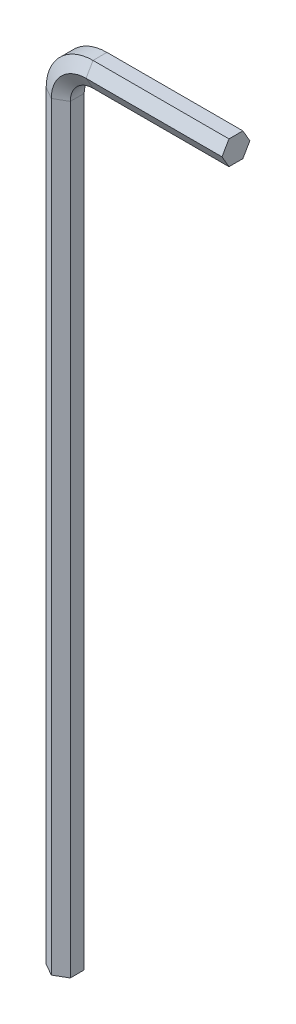
ISO-10303-21;
HEADER;
FILE_DESCRIPTION(('STEP AP214'),'2;1');
FILE_NAME('part.step','',(''),(''),'','','');
FILE_SCHEMA(('AUTOMOTIVE_DESIGN { 1 0 10303 214 1 1 1 1 }'));
ENDSEC;
DATA;
#1=APPLICATION_CONTEXT('core data for automotive mechanical design processes');
#2=APPLICATION_PROTOCOL_DEFINITION('international standard','automotive_design',2000,#1);
#3=PRODUCT_CONTEXT('',#1,'mechanical');
#4=PRODUCT('Part','Part','',(#3));
#5=PRODUCT_RELATED_PRODUCT_CATEGORY('part','',(#4));
#6=PRODUCT_DEFINITION_FORMATION('','',#4);
#7=PRODUCT_DEFINITION_CONTEXT('part definition',#1,'design');
#8=PRODUCT_DEFINITION('design','',#6,#7);
#9=PRODUCT_DEFINITION_SHAPE('','',#8);
#10=(LENGTH_UNIT() NAMED_UNIT(*) SI_UNIT(.MILLI.,.METRE.));
#11=(NAMED_UNIT(*) PLANE_ANGLE_UNIT() SI_UNIT($,.RADIAN.));
#12=(NAMED_UNIT(*) SI_UNIT($,.STERADIAN.) SOLID_ANGLE_UNIT());
#13=UNCERTAINTY_MEASURE_WITH_UNIT(LENGTH_MEASURE(1.E-05),#10,'distance_accuracy_value','');
#14=(GEOMETRIC_REPRESENTATION_CONTEXT(3) GLOBAL_UNCERTAINTY_ASSIGNED_CONTEXT((#13)) GLOBAL_UNIT_ASSIGNED_CONTEXT((#10,
#11,#12)) REPRESENTATION_CONTEXT('',''));
#15=CARTESIAN_POINT('',(0.,0.,0.));
#16=DIRECTION('',(0.,0.,1.));
#17=DIRECTION('',(1.,0.,0.));
#18=AXIS2_PLACEMENT_3D('',#15,#16,#17);
#19=CARTESIAN_POINT('',(4.00000000000003,91.2157,-1.5984519552784));
#20=DIRECTION('',(0.,0.500000000000001,-0.866025403784438));
#21=DIRECTION('',(0.,0.866025403784438,0.500000000000001));
#22=AXIS2_PLACEMENT_3D('',#19,#20,#21);
#23=PLANE('',#22);
#24=DIRECTION('',(0.,0.866025403784438,0.500000000000001));
#25=VECTOR('',#24,1.);
#26=CARTESIAN_POINT('',(4.00000000000003,91.2157,-1.5984519552784));
#27=LINE('',#26,#25);
#28=CARTESIAN_POINT('',(4.00000000000003,91.2157,-1.5984519552784));
#29=VERTEX_POINT('',#28);
#30=CARTESIAN_POINT('',(4.00000000000005,92.6,-0.799225977639195));
#31=VERTEX_POINT('',#30);
#32=EDGE_CURVE('E143',#29,#31,#27,.T.);
#33=ORIENTED_EDGE('',*,*,#32,.T.);
#34=DIRECTION('',(1.,0.,0.));
#35=VECTOR('',#34,1.);
#36=CARTESIAN_POINT('',(4.00000000000005,92.6,-0.799225977639195));
#37=LINE('',#36,#35);
#38=CARTESIAN_POINT('',(19.6157,92.6,-0.799225977639195));
#39=VERTEX_POINT('',#38);
#40=EDGE_CURVE('E23',#31,#39,#37,.T.);
#41=ORIENTED_EDGE('',*,*,#40,.T.);
#42=DIRECTION('',(0.,0.866025403784438,0.500000000000001));
#43=VECTOR('',#42,1.);
#44=CARTESIAN_POINT('',(19.6157,91.2157,-1.5984519552784));
#45=LINE('',#44,#43);
#46=CARTESIAN_POINT('',(19.6157,91.2157,-1.5984519552784));
#47=VERTEX_POINT('',#46);
#48=EDGE_CURVE('E35',#47,#39,#45,.T.);
#49=ORIENTED_EDGE('',*,*,#48,.F.);
#50=DIRECTION('',(1.,0.,0.));
#51=VECTOR('',#50,1.);
#52=CARTESIAN_POINT('',(4.00000000000003,91.2157,-1.5984519552784));
#53=LINE('',#52,#51);
#54=EDGE_CURVE('E10',#29,#47,#53,.T.);
#55=ORIENTED_EDGE('',*,*,#54,.F.);
#56=EDGE_LOOP('',(#33,#41,#49,#55));
#57=FACE_BOUND('',#56,.T.);
#58=ADVANCED_FACE('F15',(#57),#23,.T.);
#59=CARTESIAN_POINT('',(4.00000000000005,92.6,-0.799225977639195));
#60=DIRECTION('',(0.,1.,0.));
#61=DIRECTION('',(0.,0.,1.));
#62=AXIS2_PLACEMENT_3D('',#59,#60,#61);
#63=PLANE('',#62);
#64=DIRECTION('',(0.,0.,1.));
#65=VECTOR('',#64,1.);
#66=CARTESIAN_POINT('',(4.00000000000005,92.6,-0.799225977639195));
#67=LINE('',#66,#65);
#68=CARTESIAN_POINT('',(4.00000000000005,92.6,0.799225977639204));
#69=VERTEX_POINT('',#68);
#70=EDGE_CURVE('E201',#31,#69,#67,.T.);
#71=ORIENTED_EDGE('',*,*,#70,.T.);
#72=DIRECTION('',(1.,0.,0.));
#73=VECTOR('',#72,1.);
#74=CARTESIAN_POINT('',(4.00000000000005,92.6,0.799225977639204));
#75=LINE('',#74,#73);
#76=CARTESIAN_POINT('',(19.6157,92.6,0.799225977639204));
#77=VERTEX_POINT('',#76);
#78=EDGE_CURVE('E253',#69,#77,#75,.T.);
#79=ORIENTED_EDGE('',*,*,#78,.T.);
#80=DIRECTION('',(0.,0.,1.));
#81=VECTOR('',#80,1.);
#82=CARTESIAN_POINT('',(19.6157,92.6,-0.799225977639195));
#83=LINE('',#82,#81);
#84=EDGE_CURVE('E45',#39,#77,#83,.T.);
#85=ORIENTED_EDGE('',*,*,#84,.F.);
#86=ORIENTED_EDGE('',*,*,#40,.F.);
#87=EDGE_LOOP('',(#71,#79,#85,#86));
#88=FACE_BOUND('',#87,.T.);
#89=ADVANCED_FACE('F258',(#88),#63,.T.);
#90=CARTESIAN_POINT('',(4.00000000000005,92.6,0.799225977639204));
#91=DIRECTION('',(0.,0.499999999999995,0.866025403784441));
#92=DIRECTION('',(0.,-0.866025403784441,0.499999999999995));
#93=AXIS2_PLACEMENT_3D('',#90,#91,#92);
#94=PLANE('',#93);
#95=DIRECTION('',(0.,-0.866025403784441,0.499999999999995));
#96=VECTOR('',#95,1.);
#97=CARTESIAN_POINT('',(4.00000000000005,92.6,0.799225977639204));
#98=LINE('',#97,#96);
#99=CARTESIAN_POINT('',(4.00000000000003,91.2157,1.5984519552784));
#100=VERTEX_POINT('',#99);
#101=EDGE_CURVE('E197',#69,#100,#98,.T.);
#102=ORIENTED_EDGE('',*,*,#101,.T.);
#103=DIRECTION('',(1.,0.,0.));
#104=VECTOR('',#103,1.);
#105=CARTESIAN_POINT('',(4.00000000000003,91.2157,1.5984519552784));
#106=LINE('',#105,#104);
#107=CARTESIAN_POINT('',(19.6157,91.2157,1.5984519552784));
#108=VERTEX_POINT('',#107);
#109=EDGE_CURVE('E249',#100,#108,#106,.T.);
#110=ORIENTED_EDGE('',*,*,#109,.T.);
#111=DIRECTION('',(0.,-0.866025403784441,0.499999999999995));
#112=VECTOR('',#111,1.);
#113=CARTESIAN_POINT('',(19.6157,92.6,0.799225977639204));
#114=LINE('',#113,#112);
#115=EDGE_CURVE('E233',#77,#108,#114,.T.);
#116=ORIENTED_EDGE('',*,*,#115,.F.);
#117=ORIENTED_EDGE('',*,*,#78,.F.);
#118=EDGE_LOOP('',(#102,#110,#116,#117));
#119=FACE_BOUND('',#118,.T.);
#120=ADVANCED_FACE('F339',(#119),#94,.T.);
#121=CARTESIAN_POINT('',(4.00000000000003,91.2157,1.5984519552784));
#122=DIRECTION('',(0.,-0.500000000000007,0.866025403784435));
#123=DIRECTION('',(0.,-0.866025403784435,-0.500000000000007));
#124=AXIS2_PLACEMENT_3D('',#121,#122,#123);
#125=PLANE('',#124);
#126=DIRECTION('',(0.,-0.866025403784435,-0.500000000000007));
#127=VECTOR('',#126,1.);
#128=CARTESIAN_POINT('',(4.00000000000003,91.2157,1.5984519552784));
#129=LINE('',#128,#127);
#130=CARTESIAN_POINT('',(4.00000000000002,89.8314,0.799225977639185));
#131=VERTEX_POINT('',#130);
#132=EDGE_CURVE('E193',#100,#131,#129,.T.);
#133=ORIENTED_EDGE('',*,*,#132,.T.);
#134=DIRECTION('',(1.,0.,0.));
#135=VECTOR('',#134,1.);
#136=CARTESIAN_POINT('',(4.00000000000002,89.8314,0.799225977639185));
#137=LINE('',#136,#135);
#138=CARTESIAN_POINT('',(19.6157,89.8314,0.799225977639185));
#139=VERTEX_POINT('',#138);
#140=EDGE_CURVE('E245',#131,#139,#137,.T.);
#141=ORIENTED_EDGE('',*,*,#140,.T.);
#142=DIRECTION('',(0.,-0.866025403784435,-0.500000000000007));
#143=VECTOR('',#142,1.);
#144=CARTESIAN_POINT('',(19.6157,91.2157,1.5984519552784));
#145=LINE('',#144,#143);
#146=EDGE_CURVE('E229',#108,#139,#145,.T.);
#147=ORIENTED_EDGE('',*,*,#146,.F.);
#148=ORIENTED_EDGE('',*,*,#109,.F.);
#149=EDGE_LOOP('',(#133,#141,#147,#148));
#150=FACE_BOUND('',#149,.T.);
#151=ADVANCED_FACE('F338',(#150),#125,.T.);
#152=CARTESIAN_POINT('',(4.00000000000002,89.8314,0.799225977639185));
#153=DIRECTION('',(0.,-1.,0.));
#154=DIRECTION('',(0.,0.,-1.));
#155=AXIS2_PLACEMENT_3D('',#152,#153,#154);
#156=PLANE('',#155);
#157=DIRECTION('',(0.,0.,-1.));
#158=VECTOR('',#157,1.);
#159=CARTESIAN_POINT('',(4.00000000000002,89.8314,0.799225977639185));
#160=LINE('',#159,#158);
#161=CARTESIAN_POINT('',(4.00000000000002,89.8314,-0.799225977639214));
#162=VERTEX_POINT('',#161);
#163=EDGE_CURVE('E184',#131,#162,#160,.T.);
#164=ORIENTED_EDGE('',*,*,#163,.T.);
#165=DIRECTION('',(1.,0.,0.));
#166=VECTOR('',#165,1.);
#167=CARTESIAN_POINT('',(4.00000000000002,89.8314,-0.799225977639214));
#168=LINE('',#167,#166);
#169=CARTESIAN_POINT('',(19.6157,89.8314,-0.799225977639214));
#170=VERTEX_POINT('',#169);
#171=EDGE_CURVE('E241',#162,#170,#168,.T.);
#172=ORIENTED_EDGE('',*,*,#171,.T.);
#173=DIRECTION('',(0.,0.,-1.));
#174=VECTOR('',#173,1.);
#175=CARTESIAN_POINT('',(19.6157,89.8314,0.799225977639185));
#176=LINE('',#175,#174);
#177=EDGE_CURVE('E225',#139,#170,#176,.T.);
#178=ORIENTED_EDGE('',*,*,#177,.F.);
#179=ORIENTED_EDGE('',*,*,#140,.F.);
#180=EDGE_LOOP('',(#164,#172,#178,#179));
#181=FACE_BOUND('',#180,.T.);
#182=ADVANCED_FACE('F345',(#181),#156,.T.);
#183=CARTESIAN_POINT('',(4.00000000000002,89.8314,-0.799225977639214));
#184=DIRECTION('',(0.,-0.499999999999995,-0.866025403784442));
#185=DIRECTION('',(0.,0.866025403784441,-0.499999999999995));
#186=AXIS2_PLACEMENT_3D('',#183,#184,#185);
#187=PLANE('',#186);
#188=DIRECTION('',(0.,0.866025403784442,-0.499999999999995));
#189=VECTOR('',#188,1.);
#190=CARTESIAN_POINT('',(4.00000000000002,89.8314,-0.799225977639214));
#191=LINE('',#190,#189);
#192=EDGE_CURVE('E177',#162,#29,#191,.T.);
#193=ORIENTED_EDGE('',*,*,#192,.T.);
#194=ORIENTED_EDGE('',*,*,#54,.T.);
#195=DIRECTION('',(0.,0.866025403784442,-0.499999999999995));
#196=VECTOR('',#195,1.);
#197=CARTESIAN_POINT('',(19.6157,89.8314,-0.799225977639214));
#198=LINE('',#197,#196);
#199=EDGE_CURVE('E147',#170,#47,#198,.T.);
#200=ORIENTED_EDGE('',*,*,#199,.F.);
#201=ORIENTED_EDGE('',*,*,#171,.F.);
#202=EDGE_LOOP('',(#193,#194,#200,#201));
#203=FACE_BOUND('',#202,.T.);
#204=ADVANCED_FACE('F343',(#203),#187,.T.);
#205=CARTESIAN_POINT('',(4.,87.2157,-1.5984519552784));
#206=DIRECTION('',(0.,0.,1.));
#207=DIRECTION('',(1.,0.,0.));
#208=AXIS2_PLACEMENT_3D('',#205,#206,#207);
#209=CONICAL_SURFACE('',#208,4.,1.0471975511966);
#210=DIRECTION('',(-0.866025403784438,0.,0.500000000000001));
#211=VECTOR('',#210,1.);
#212=CARTESIAN_POINT('',(0.,87.2157,-1.5984519552784));
#213=LINE('',#212,#211);
#214=CARTESIAN_POINT('',(0.,87.2157,-1.5984519552784));
#215=VERTEX_POINT('',#214);
#216=CARTESIAN_POINT('',(-1.3843,87.2157,-0.799225977639195));
#217=VERTEX_POINT('',#216);
#218=EDGE_CURVE('E140',#215,#217,#213,.T.);
#219=ORIENTED_EDGE('',*,*,#218,.T.);
#220=CARTESIAN_POINT('',(4.,87.2157,-0.799225977639195));
#221=DIRECTION('',(0.,0.,-1.));
#222=DIRECTION('',(-1.,0.,0.));
#223=AXIS2_PLACEMENT_3D('',#220,#221,#222);
#224=CIRCLE('',#223,5.3843);
#225=EDGE_CURVE('E148',#217,#31,#224,.T.);
#226=ORIENTED_EDGE('',*,*,#225,.T.);
#227=ORIENTED_EDGE('',*,*,#32,.F.);
#228=CARTESIAN_POINT('',(4.,87.2157,-1.5984519552784));
#229=DIRECTION('',(0.,0.,-1.));
#230=DIRECTION('',(-1.,0.,0.));
#231=AXIS2_PLACEMENT_3D('',#228,#229,#230);
#232=CIRCLE('',#231,4.);
#233=EDGE_CURVE('E135',#215,#29,#232,.T.);
#234=ORIENTED_EDGE('',*,*,#233,.F.);
#235=EDGE_LOOP('',(#219,#226,#227,#234));
#236=FACE_BOUND('',#235,.T.);
#237=ADVANCED_FACE('F137',(#236),#209,.T.);
#238=CARTESIAN_POINT('',(4.,87.2157,0.));
#239=DIRECTION('',(0.,0.,-1.));
#240=DIRECTION('',(-1.,0.,0.));
#241=AXIS2_PLACEMENT_3D('',#238,#239,#240);
#242=CYLINDRICAL_SURFACE('',#241,5.3843);
#243=DIRECTION('',(0.,0.,1.));
#244=VECTOR('',#243,1.);
#245=CARTESIAN_POINT('',(-1.3843,87.2157,-0.799225977639195));
#246=LINE('',#245,#244);
#247=CARTESIAN_POINT('',(-1.38429999999999,87.2157,0.799225977639204));
#248=VERTEX_POINT('',#247);
#249=EDGE_CURVE('E171',#217,#248,#246,.T.);
#250=ORIENTED_EDGE('',*,*,#249,.T.);
#251=CARTESIAN_POINT('',(4.,87.2157,0.799225977639204));
#252=DIRECTION('',(0.,0.,-1.));
#253=DIRECTION('',(-1.,0.,0.));
#254=AXIS2_PLACEMENT_3D('',#251,#252,#253);
#255=CIRCLE('',#254,5.38429999999999);
#256=EDGE_CURVE('E217',#248,#69,#255,.T.);
#257=ORIENTED_EDGE('',*,*,#256,.T.);
#258=ORIENTED_EDGE('',*,*,#70,.F.);
#259=ORIENTED_EDGE('',*,*,#225,.F.);
#260=EDGE_LOOP('',(#250,#257,#258,#259));
#261=FACE_BOUND('',#260,.T.);
#262=ADVANCED_FACE('F267',(#261),#242,.T.);
#263=CARTESIAN_POINT('',(4.,87.2157,0.799225977639204));
#264=DIRECTION('',(0.,0.,-1.));
#265=DIRECTION('',(-1.,0.,0.));
#266=AXIS2_PLACEMENT_3D('',#263,#264,#265);
#267=CONICAL_SURFACE('',#266,5.38429999999999,1.0471975511966);
#268=DIRECTION('',(0.866025403784441,0.,0.499999999999995));
#269=VECTOR('',#268,1.);
#270=CARTESIAN_POINT('',(-1.38429999999999,87.2157,0.799225977639204));
#271=LINE('',#270,#269);
#272=CARTESIAN_POINT('',(0.,87.2157,1.5984519552784));
#273=VERTEX_POINT('',#272);
#274=EDGE_CURVE('E271',#248,#273,#271,.T.);
#275=ORIENTED_EDGE('',*,*,#274,.T.);
#276=CARTESIAN_POINT('',(4.,87.2157,1.5984519552784));
#277=DIRECTION('',(0.,0.,-1.));
#278=DIRECTION('',(-1.,0.,0.));
#279=AXIS2_PLACEMENT_3D('',#276,#277,#278);
#280=CIRCLE('',#279,3.99999999999999);
#281=EDGE_CURVE('E213',#273,#100,#280,.T.);
#282=ORIENTED_EDGE('',*,*,#281,.T.);
#283=ORIENTED_EDGE('',*,*,#101,.F.);
#284=ORIENTED_EDGE('',*,*,#256,.F.);
#285=EDGE_LOOP('',(#275,#282,#283,#284));
#286=FACE_BOUND('',#285,.T.);
#287=ADVANCED_FACE('F263',(#286),#267,.T.);
#288=CARTESIAN_POINT('',(4.,87.2157,1.5984519552784));
#289=DIRECTION('',(0.,0.,1.));
#290=DIRECTION('',(1.,0.,0.));
#291=AXIS2_PLACEMENT_3D('',#288,#289,#290);
#292=CONICAL_SURFACE('',#291,3.99999999999999,1.04719755119659);
#293=DIRECTION('',(0.866025403784435,0.,-0.500000000000007));
#294=VECTOR('',#293,1.);
#295=CARTESIAN_POINT('',(0.,87.2157,1.5984519552784));
#296=LINE('',#295,#294);
#297=CARTESIAN_POINT('',(1.38430000000001,87.2157,0.799225977639185));
#298=VERTEX_POINT('',#297);
#299=EDGE_CURVE('E287',#273,#298,#296,.T.);
#300=ORIENTED_EDGE('',*,*,#299,.T.);
#301=CARTESIAN_POINT('',(4.,87.2157,0.799225977639185));
#302=DIRECTION('',(0.,0.,-1.));
#303=DIRECTION('',(-1.,0.,0.));
#304=AXIS2_PLACEMENT_3D('',#301,#302,#303);
#305=CIRCLE('',#304,2.61569999999999);
#306=EDGE_CURVE('E209',#298,#131,#305,.T.);
#307=ORIENTED_EDGE('',*,*,#306,.T.);
#308=ORIENTED_EDGE('',*,*,#132,.F.);
#309=ORIENTED_EDGE('',*,*,#281,.F.);
#310=EDGE_LOOP('',(#300,#307,#308,#309));
#311=FACE_BOUND('',#310,.T.);
#312=ADVANCED_FACE('F336',(#311),#292,.F.);
#313=CARTESIAN_POINT('',(4.,87.2157,0.));
#314=DIRECTION('',(0.,0.,-1.));
#315=DIRECTION('',(-1.,0.,0.));
#316=AXIS2_PLACEMENT_3D('',#313,#314,#315);
#317=CYLINDRICAL_SURFACE('',#316,2.6157);
#318=DIRECTION('',(0.,0.,-1.));
#319=VECTOR('',#318,1.);
#320=CARTESIAN_POINT('',(1.38430000000001,87.2157,0.799225977639185));
#321=LINE('',#320,#319);
#322=CARTESIAN_POINT('',(1.38429999999999,87.2157,-0.799225977639214));
#323=VERTEX_POINT('',#322);
#324=EDGE_CURVE('E292',#298,#323,#321,.T.);
#325=ORIENTED_EDGE('',*,*,#324,.T.);
#326=CARTESIAN_POINT('',(4.,87.2157,-0.799225977639214));
#327=DIRECTION('',(0.,0.,-1.));
#328=DIRECTION('',(-1.,0.,0.));
#329=AXIS2_PLACEMENT_3D('',#326,#327,#328);
#330=CIRCLE('',#329,2.61570000000001);
#331=EDGE_CURVE('E154',#323,#162,#330,.T.);
#332=ORIENTED_EDGE('',*,*,#331,.T.);
#333=ORIENTED_EDGE('',*,*,#163,.F.);
#334=ORIENTED_EDGE('',*,*,#306,.F.);
#335=EDGE_LOOP('',(#325,#332,#333,#334));
#336=FACE_BOUND('',#335,.T.);
#337=ADVANCED_FACE('F333',(#336),#317,.F.);
#338=CARTESIAN_POINT('',(4.,87.2157,-0.799225977639214));
#339=DIRECTION('',(0.,0.,-1.));
#340=DIRECTION('',(-1.,0.,0.));
#341=AXIS2_PLACEMENT_3D('',#338,#339,#340);
#342=CONICAL_SURFACE('',#341,2.61570000000001,1.0471975511966);
#343=DIRECTION('',(-0.866025403784442,0.,-0.499999999999995));
#344=VECTOR('',#343,1.);
#345=CARTESIAN_POINT('',(1.38429999999999,87.2157,-0.799225977639214));
#346=LINE('',#345,#344);
#347=EDGE_CURVE('E151',#323,#215,#346,.T.);
#348=ORIENTED_EDGE('',*,*,#347,.T.);
#349=ORIENTED_EDGE('',*,*,#233,.T.);
#350=ORIENTED_EDGE('',*,*,#192,.F.);
#351=ORIENTED_EDGE('',*,*,#331,.F.);
#352=EDGE_LOOP('',(#348,#349,#350,#351));
#353=FACE_BOUND('',#352,.T.);
#354=ADVANCED_FACE('F152',(#353),#342,.F.);
#355=CARTESIAN_POINT('',(1.38429999999999,87.2157,-0.799225977639214));
#356=DIRECTION('',(-0.499999999999995,0.,0.866025403784442));
#357=DIRECTION('',(0.866025403784442,0.,0.499999999999995));
#358=AXIS2_PLACEMENT_3D('',#355,#356,#357);
#359=PLANE('',#358);
#360=DIRECTION('',(-0.866025403784442,0.,-0.499999999999995));
#361=VECTOR('',#360,1.);
#362=CARTESIAN_POINT('',(1.38429999999999,0.,-0.799225977639214));
#363=LINE('',#362,#361);
#364=CARTESIAN_POINT('',(1.38429999999999,0.,-0.799225977639214));
#365=VERTEX_POINT('',#364);
#366=CARTESIAN_POINT('',(0.,0.,-1.5984519552784));
#367=VERTEX_POINT('',#366);
#368=EDGE_CURVE('E175',#365,#367,#363,.T.);
#369=ORIENTED_EDGE('',*,*,#368,.T.);
#370=DIRECTION('',(0.,-1.,0.));
#371=VECTOR('',#370,1.);
#372=CARTESIAN_POINT('',(0.,87.2157,-1.5984519552784));
#373=LINE('',#372,#371);
#374=EDGE_CURVE('E165',#215,#367,#373,.T.);
#375=ORIENTED_EDGE('',*,*,#374,.F.);
#376=ORIENTED_EDGE('',*,*,#347,.F.);
#377=DIRECTION('',(0.,-1.,0.));
#378=VECTOR('',#377,1.);
#379=CARTESIAN_POINT('',(1.38429999999999,87.2157,-0.799225977639214));
#380=LINE('',#379,#378);
#381=EDGE_CURVE('E297',#323,#365,#380,.T.);
#382=ORIENTED_EDGE('',*,*,#381,.T.);
#383=EDGE_LOOP('',(#369,#375,#376,#382));
#384=FACE_BOUND('',#383,.T.);
#385=ADVANCED_FACE('F173',(#384),#359,.F.);
#386=CARTESIAN_POINT('',(0.,87.2157,-1.5984519552784));
#387=DIRECTION('',(0.500000000000001,0.,0.866025403784438));
#388=DIRECTION('',(0.866025403784438,0.,-0.500000000000001));
#389=AXIS2_PLACEMENT_3D('',#386,#387,#388);
#390=PLANE('',#389);
#391=DIRECTION('',(-0.866025403784438,0.,0.500000000000001));
#392=VECTOR('',#391,1.);
#393=CARTESIAN_POINT('',(0.,0.,-1.5984519552784));
#394=LINE('',#393,#392);
#395=CARTESIAN_POINT('',(-1.3843,0.,-0.799225977639195));
#396=VERTEX_POINT('',#395);
#397=EDGE_CURVE('E300',#367,#396,#394,.T.);
#398=ORIENTED_EDGE('',*,*,#397,.T.);
#399=DIRECTION('',(0.,-1.,0.));
#400=VECTOR('',#399,1.);
#401=CARTESIAN_POINT('',(-1.3843,87.2157,-0.799225977639195));
#402=LINE('',#401,#400);
#403=EDGE_CURVE('E168',#217,#396,#402,.T.);
#404=ORIENTED_EDGE('',*,*,#403,.F.);
#405=ORIENTED_EDGE('',*,*,#218,.F.);
#406=ORIENTED_EDGE('',*,*,#374,.T.);
#407=EDGE_LOOP('',(#398,#404,#405,#406));
#408=FACE_BOUND('',#407,.T.);
#409=ADVANCED_FACE('F164',(#408),#390,.F.);
#410=CARTESIAN_POINT('',(-1.3843,87.2157,-0.799225977639195));
#411=DIRECTION('',(1.,0.,0.));
#412=DIRECTION('',(0.,0.,-1.));
#413=AXIS2_PLACEMENT_3D('',#410,#411,#412);
#414=PLANE('',#413);
#415=DIRECTION('',(0.,0.,1.));
#416=VECTOR('',#415,1.);
#417=CARTESIAN_POINT('',(-1.3843,0.,-0.799225977639195));
#418=LINE('',#417,#416);
#419=CARTESIAN_POINT('',(-1.38429999999999,0.,0.799225977639204));
#420=VERTEX_POINT('',#419);
#421=EDGE_CURVE('E277',#396,#420,#418,.T.);
#422=ORIENTED_EDGE('',*,*,#421,.T.);
#423=DIRECTION('',(0.,-1.,0.));
#424=VECTOR('',#423,1.);
#425=CARTESIAN_POINT('',(-1.38429999999999,87.2157,0.799225977639204));
#426=LINE('',#425,#424);
#427=EDGE_CURVE('E186',#248,#420,#426,.T.);
#428=ORIENTED_EDGE('',*,*,#427,.F.);
#429=ORIENTED_EDGE('',*,*,#249,.F.);
#430=ORIENTED_EDGE('',*,*,#403,.T.);
#431=EDGE_LOOP('',(#422,#428,#429,#430));
#432=FACE_BOUND('',#431,.T.);
#433=ADVANCED_FACE('F275',(#432),#414,.F.);
#434=CARTESIAN_POINT('',(-1.38429999999999,87.2157,0.799225977639204));
#435=DIRECTION('',(0.499999999999995,0.,-0.866025403784441));
#436=DIRECTION('',(-0.866025403784441,0.,-0.499999999999995));
#437=AXIS2_PLACEMENT_3D('',#434,#435,#436);
#438=PLANE('',#437);
#439=DIRECTION('',(0.866025403784441,0.,0.499999999999995));
#440=VECTOR('',#439,1.);
#441=CARTESIAN_POINT('',(-1.38429999999999,0.,0.799225977639204));
#442=LINE('',#441,#440);
#443=CARTESIAN_POINT('',(0.,0.,1.5984519552784));
#444=VERTEX_POINT('',#443);
#445=EDGE_CURVE('E305',#420,#444,#442,.T.);
#446=ORIENTED_EDGE('',*,*,#445,.T.);
#447=DIRECTION('',(0.,-1.,0.));
#448=VECTOR('',#447,1.);
#449=CARTESIAN_POINT('',(0.,87.2157,1.5984519552784));
#450=LINE('',#449,#448);
#451=EDGE_CURVE('E281',#273,#444,#450,.T.);
#452=ORIENTED_EDGE('',*,*,#451,.F.);
#453=ORIENTED_EDGE('',*,*,#274,.F.);
#454=ORIENTED_EDGE('',*,*,#427,.T.);
#455=EDGE_LOOP('',(#446,#452,#453,#454));
#456=FACE_BOUND('',#455,.T.);
#457=ADVANCED_FACE('F283',(#456),#438,.F.);
#458=CARTESIAN_POINT('',(0.,87.2157,1.5984519552784));
#459=DIRECTION('',(-0.500000000000007,0.,-0.866025403784435));
#460=DIRECTION('',(-0.866025403784435,0.,0.500000000000007));
#461=AXIS2_PLACEMENT_3D('',#458,#459,#460);
#462=PLANE('',#461);
#463=DIRECTION('',(0.866025403784435,0.,-0.500000000000007));
#464=VECTOR('',#463,1.);
#465=CARTESIAN_POINT('',(0.,0.,1.5984519552784));
#466=LINE('',#465,#464);
#467=CARTESIAN_POINT('',(1.38430000000001,0.,0.799225977639185));
#468=VERTEX_POINT('',#467);
#469=EDGE_CURVE('E308',#444,#468,#466,.T.);
#470=ORIENTED_EDGE('',*,*,#469,.T.);
#471=DIRECTION('',(0.,-1.,0.));
#472=VECTOR('',#471,1.);
#473=CARTESIAN_POINT('',(1.38430000000001,87.2157,0.799225977639185));
#474=LINE('',#473,#472);
#475=EDGE_CURVE('E315',#298,#468,#474,.T.);
#476=ORIENTED_EDGE('',*,*,#475,.F.);
#477=ORIENTED_EDGE('',*,*,#299,.F.);
#478=ORIENTED_EDGE('',*,*,#451,.T.);
#479=EDGE_LOOP('',(#470,#476,#477,#478));
#480=FACE_BOUND('',#479,.T.);
#481=ADVANCED_FACE('F323',(#480),#462,.F.);
#482=CARTESIAN_POINT('',(1.38430000000001,87.2157,0.799225977639185));
#483=DIRECTION('',(-1.,0.,0.));
#484=DIRECTION('',(0.,0.,1.));
#485=AXIS2_PLACEMENT_3D('',#482,#483,#484);
#486=PLANE('',#485);
#487=DIRECTION('',(0.,0.,-1.));
#488=VECTOR('',#487,1.);
#489=CARTESIAN_POINT('',(1.38430000000001,0.,0.799225977639185));
#490=LINE('',#489,#488);
#491=EDGE_CURVE('E160',#468,#365,#490,.T.);
#492=ORIENTED_EDGE('',*,*,#491,.T.);
#493=ORIENTED_EDGE('',*,*,#381,.F.);
#494=ORIENTED_EDGE('',*,*,#324,.F.);
#495=ORIENTED_EDGE('',*,*,#475,.T.);
#496=EDGE_LOOP('',(#492,#493,#494,#495));
#497=FACE_BOUND('',#496,.T.);
#498=ADVANCED_FACE('F330',(#497),#486,.F.);
#499=CARTESIAN_POINT('',(19.6157,91.2157,0.));
#500=DIRECTION('',(1.,0.,0.));
#501=DIRECTION('',(0.,0.,1.));
#502=AXIS2_PLACEMENT_3D('',#499,#500,#501);
#503=PLANE('',#502);
#504=ORIENTED_EDGE('',*,*,#199,.T.);
#505=ORIENTED_EDGE('',*,*,#48,.T.);
#506=ORIENTED_EDGE('',*,*,#84,.T.);
#507=ORIENTED_EDGE('',*,*,#115,.T.);
#508=ORIENTED_EDGE('',*,*,#146,.T.);
#509=ORIENTED_EDGE('',*,*,#177,.T.);
#510=EDGE_LOOP('',(#504,#505,#506,#507,#508,#509));
#511=FACE_BOUND('',#510,.T.);
#512=ADVANCED_FACE('F341',(#511),#503,.T.);
#513=CARTESIAN_POINT('',(0.,0.,0.));
#514=DIRECTION('',(0.,1.,0.));
#515=DIRECTION('',(0.,0.,1.));
#516=AXIS2_PLACEMENT_3D('',#513,#514,#515);
#517=PLANE('',#516);
#518=ORIENTED_EDGE('',*,*,#368,.F.);
#519=ORIENTED_EDGE('',*,*,#491,.F.);
#520=ORIENTED_EDGE('',*,*,#469,.F.);
#521=ORIENTED_EDGE('',*,*,#445,.F.);
#522=ORIENTED_EDGE('',*,*,#421,.F.);
#523=ORIENTED_EDGE('',*,*,#397,.F.);
#524=EDGE_LOOP('',(#518,#519,#520,#521,#522,#523));
#525=FACE_BOUND('',#524,.T.);
#526=ADVANCED_FACE('F327',(#525),#517,.F.);
#527=CLOSED_SHELL('',(#58,#89,#120,#151,#182,#204,#237,#262,#287,#312,#337,#354,#385,#409,#433,
#457,#481,#498,#512,#526));
#528=MANIFOLD_SOLID_BREP('B1',#527);
#529=ADVANCED_BREP_SHAPE_REPRESENTATION('',(#18,#528),#14);
#530=SHAPE_DEFINITION_REPRESENTATION(#9,#529);
ENDSEC;
END-ISO-10303-21;
